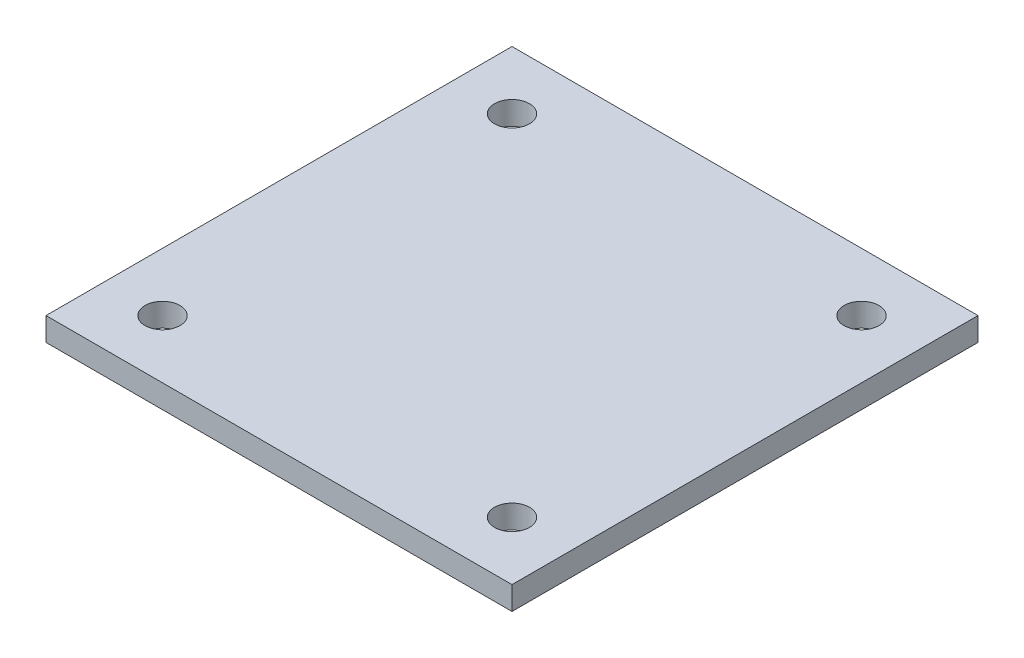
ISO-10303-21;
HEADER;
FILE_DESCRIPTION(('STEP AP214'),'2;1');
FILE_NAME('part.step','',(''),(''),'','','');
FILE_SCHEMA(('AUTOMOTIVE_DESIGN { 1 0 10303 214 1 1 1 1 }'));
ENDSEC;
DATA;
#1=APPLICATION_CONTEXT('core data for automotive mechanical design processes');
#2=APPLICATION_PROTOCOL_DEFINITION('international standard','automotive_design',2000,#1);
#3=PRODUCT_CONTEXT('',#1,'mechanical');
#4=PRODUCT('Part','Part','',(#3));
#5=PRODUCT_RELATED_PRODUCT_CATEGORY('part','',(#4));
#6=PRODUCT_DEFINITION_FORMATION('','',#4);
#7=PRODUCT_DEFINITION_CONTEXT('part definition',#1,'design');
#8=PRODUCT_DEFINITION('design','',#6,#7);
#9=PRODUCT_DEFINITION_SHAPE('','',#8);
#10=(LENGTH_UNIT() NAMED_UNIT(*) SI_UNIT(.MILLI.,.METRE.));
#11=(NAMED_UNIT(*) PLANE_ANGLE_UNIT() SI_UNIT($,.RADIAN.));
#12=(NAMED_UNIT(*) SI_UNIT($,.STERADIAN.) SOLID_ANGLE_UNIT());
#13=UNCERTAINTY_MEASURE_WITH_UNIT(LENGTH_MEASURE(1.E-05),#10,'distance_accuracy_value','');
#14=(GEOMETRIC_REPRESENTATION_CONTEXT(3) GLOBAL_UNCERTAINTY_ASSIGNED_CONTEXT((#13)) GLOBAL_UNIT_ASSIGNED_CONTEXT((#10,
#11,#12)) REPRESENTATION_CONTEXT('',''));
#15=CARTESIAN_POINT('',(0.,0.,0.));
#16=DIRECTION('',(0.,0.,1.));
#17=DIRECTION('',(1.,0.,0.));
#18=AXIS2_PLACEMENT_3D('',#15,#16,#17);
#19=CARTESIAN_POINT('',(0.,2.,0.));
#20=DIRECTION('',(1.,0.,0.));
#21=DIRECTION('',(0.,0.,-1.));
#22=AXIS2_PLACEMENT_3D('',#19,#20,#21);
#23=PLANE('',#22);
#24=DIRECTION('',(0.,0.,1.));
#25=VECTOR('',#24,1.);
#26=CARTESIAN_POINT('',(0.,0.,0.));
#27=LINE('',#26,#25);
#28=CARTESIAN_POINT('',(0.,0.,-40.));
#29=VERTEX_POINT('',#28);
#30=CARTESIAN_POINT('',(0.,0.,0.));
#31=VERTEX_POINT('',#30);
#32=EDGE_CURVE('E95',#29,#31,#27,.T.);
#33=ORIENTED_EDGE('',*,*,#32,.T.);
#34=DIRECTION('',(0.,-1.,0.));
#35=VECTOR('',#34,1.);
#36=CARTESIAN_POINT('',(0.,2.,0.));
#37=LINE('',#36,#35);
#38=CARTESIAN_POINT('',(0.,2.,0.));
#39=VERTEX_POINT('',#38);
#40=EDGE_CURVE('E11',#39,#31,#37,.T.);
#41=ORIENTED_EDGE('',*,*,#40,.F.);
#42=DIRECTION('',(0.,0.,1.));
#43=VECTOR('',#42,1.);
#44=CARTESIAN_POINT('',(0.,2.,0.));
#45=LINE('',#44,#43);
#46=CARTESIAN_POINT('',(0.,2.,-40.));
#47=VERTEX_POINT('',#46);
#48=EDGE_CURVE('E83',#47,#39,#45,.T.);
#49=ORIENTED_EDGE('',*,*,#48,.F.);
#50=DIRECTION('',(0.,-1.,0.));
#51=VECTOR('',#50,1.);
#52=CARTESIAN_POINT('',(0.,2.,-40.));
#53=LINE('',#52,#51);
#54=EDGE_CURVE('E91',#47,#29,#53,.T.);
#55=ORIENTED_EDGE('',*,*,#54,.T.);
#56=EDGE_LOOP('',(#33,#41,#49,#55));
#57=FACE_BOUND('',#56,.T.);
#58=ADVANCED_FACE('F32',(#57),#23,.F.);
#59=CARTESIAN_POINT('',(0.,2.,0.));
#60=DIRECTION('',(0.,0.,-1.));
#61=DIRECTION('',(-1.,0.,0.));
#62=AXIS2_PLACEMENT_3D('',#59,#60,#61);
#63=PLANE('',#62);
#64=DIRECTION('',(1.,0.,0.));
#65=VECTOR('',#64,1.);
#66=CARTESIAN_POINT('',(0.,0.,0.));
#67=LINE('',#66,#65);
#68=CARTESIAN_POINT('',(40.,0.,0.));
#69=VERTEX_POINT('',#68);
#70=EDGE_CURVE('E87',#31,#69,#67,.T.);
#71=ORIENTED_EDGE('',*,*,#70,.T.);
#72=DIRECTION('',(0.,-1.,0.));
#73=VECTOR('',#72,1.);
#74=CARTESIAN_POINT('',(40.,2.,0.));
#75=LINE('',#74,#73);
#76=CARTESIAN_POINT('',(40.,2.,0.));
#77=VERTEX_POINT('',#76);
#78=EDGE_CURVE('E40',#77,#69,#75,.T.);
#79=ORIENTED_EDGE('',*,*,#78,.F.);
#80=DIRECTION('',(1.,0.,0.));
#81=VECTOR('',#80,1.);
#82=CARTESIAN_POINT('',(0.,2.,0.));
#83=LINE('',#82,#81);
#84=EDGE_CURVE('E78',#39,#77,#83,.T.);
#85=ORIENTED_EDGE('',*,*,#84,.F.);
#86=ORIENTED_EDGE('',*,*,#40,.T.);
#87=EDGE_LOOP('',(#71,#79,#85,#86));
#88=FACE_BOUND('',#87,.T.);
#89=ADVANCED_FACE('F86',(#88),#63,.F.);
#90=CARTESIAN_POINT('',(40.,2.,0.));
#91=DIRECTION('',(-1.,0.,0.));
#92=DIRECTION('',(0.,0.,1.));
#93=AXIS2_PLACEMENT_3D('',#90,#91,#92);
#94=PLANE('',#93);
#95=DIRECTION('',(0.,0.,-1.));
#96=VECTOR('',#95,1.);
#97=CARTESIAN_POINT('',(40.,0.,0.));
#98=LINE('',#97,#96);
#99=CARTESIAN_POINT('',(40.,0.,-40.));
#100=VERTEX_POINT('',#99);
#101=EDGE_CURVE('E65',#69,#100,#98,.T.);
#102=ORIENTED_EDGE('',*,*,#101,.T.);
#103=DIRECTION('',(0.,-1.,0.));
#104=VECTOR('',#103,1.);
#105=CARTESIAN_POINT('',(40.,2.,-40.));
#106=LINE('',#105,#104);
#107=CARTESIAN_POINT('',(40.,2.,-40.));
#108=VERTEX_POINT('',#107);
#109=EDGE_CURVE('E88',#108,#100,#106,.T.);
#110=ORIENTED_EDGE('',*,*,#109,.F.);
#111=DIRECTION('',(0.,0.,-1.));
#112=VECTOR('',#111,1.);
#113=CARTESIAN_POINT('',(40.,2.,0.));
#114=LINE('',#113,#112);
#115=EDGE_CURVE('E81',#77,#108,#114,.T.);
#116=ORIENTED_EDGE('',*,*,#115,.F.);
#117=ORIENTED_EDGE('',*,*,#78,.T.);
#118=EDGE_LOOP('',(#102,#110,#116,#117));
#119=FACE_BOUND('',#118,.T.);
#120=ADVANCED_FACE('F89',(#119),#94,.F.);
#121=CARTESIAN_POINT('',(0.,2.,-40.));
#122=DIRECTION('',(0.,0.,1.));
#123=DIRECTION('',(1.,0.,0.));
#124=AXIS2_PLACEMENT_3D('',#121,#122,#123);
#125=PLANE('',#124);
#126=DIRECTION('',(-1.,0.,0.));
#127=VECTOR('',#126,1.);
#128=CARTESIAN_POINT('',(0.,0.,-40.));
#129=LINE('',#128,#127);
#130=EDGE_CURVE('E71',#100,#29,#129,.T.);
#131=ORIENTED_EDGE('',*,*,#130,.T.);
#132=ORIENTED_EDGE('',*,*,#54,.F.);
#133=DIRECTION('',(-1.,0.,0.));
#134=VECTOR('',#133,1.);
#135=CARTESIAN_POINT('',(0.,2.,-40.));
#136=LINE('',#135,#134);
#137=EDGE_CURVE('E48',#108,#47,#136,.T.);
#138=ORIENTED_EDGE('',*,*,#137,.F.);
#139=ORIENTED_EDGE('',*,*,#109,.T.);
#140=EDGE_LOOP('',(#131,#132,#138,#139));
#141=FACE_BOUND('',#140,.T.);
#142=ADVANCED_FACE('F103',(#141),#125,.F.);
#143=CARTESIAN_POINT('',(0.,2.,0.));
#144=DIRECTION('',(0.,-1.,0.));
#145=DIRECTION('',(0.,0.,-1.));
#146=AXIS2_PLACEMENT_3D('',#143,#144,#145);
#147=PLANE('',#146);
#148=CARTESIAN_POINT('',(35.,2.,-35.));
#149=DIRECTION('',(0.,-1.,0.));
#150=DIRECTION('',(0.,0.,-1.));
#151=AXIS2_PLACEMENT_3D('',#148,#149,#150);
#152=CIRCLE('',#151,1.5);
#153=CARTESIAN_POINT('',(35.,2.,-36.5));
#154=VERTEX_POINT('',#153);
#155=EDGE_CURVE('E114',#154,#154,#152,.F.);
#156=ORIENTED_EDGE('',*,*,#155,.F.);
#157=EDGE_LOOP('',(#156));
#158=FACE_BOUND('',#157,.T.);
#159=CARTESIAN_POINT('',(5.,2.,-5.));
#160=DIRECTION('',(0.,-1.,0.));
#161=DIRECTION('',(0.,0.,-1.));
#162=AXIS2_PLACEMENT_3D('',#159,#160,#161);
#163=CIRCLE('',#162,1.5);
#164=CARTESIAN_POINT('',(5.,2.,-6.5));
#165=VERTEX_POINT('',#164);
#166=EDGE_CURVE('E122',#165,#165,#163,.F.);
#167=ORIENTED_EDGE('',*,*,#166,.F.);
#168=EDGE_LOOP('',(#167));
#169=FACE_BOUND('',#168,.T.);
#170=CARTESIAN_POINT('',(5.,2.,-35.));
#171=DIRECTION('',(0.,-1.,0.));
#172=DIRECTION('',(0.,0.,-1.));
#173=AXIS2_PLACEMENT_3D('',#170,#171,#172);
#174=CIRCLE('',#173,1.5);
#175=CARTESIAN_POINT('',(5.,2.,-36.5));
#176=VERTEX_POINT('',#175);
#177=EDGE_CURVE('E115',#176,#176,#174,.F.);
#178=ORIENTED_EDGE('',*,*,#177,.F.);
#179=EDGE_LOOP('',(#178));
#180=FACE_BOUND('',#179,.T.);
#181=CARTESIAN_POINT('',(35.,2.,-5.));
#182=DIRECTION('',(0.,-1.,0.));
#183=DIRECTION('',(0.,0.,-1.));
#184=AXIS2_PLACEMENT_3D('',#181,#182,#183);
#185=CIRCLE('',#184,1.5);
#186=CARTESIAN_POINT('',(35.,2.,-6.50000000000001));
#187=VERTEX_POINT('',#186);
#188=EDGE_CURVE('E98',#187,#187,#185,.F.);
#189=ORIENTED_EDGE('',*,*,#188,.F.);
#190=EDGE_LOOP('',(#189));
#191=FACE_BOUND('',#190,.T.);
#192=ORIENTED_EDGE('',*,*,#48,.T.);
#193=ORIENTED_EDGE('',*,*,#84,.T.);
#194=ORIENTED_EDGE('',*,*,#115,.T.);
#195=ORIENTED_EDGE('',*,*,#137,.T.);
#196=EDGE_LOOP('',(#192,#193,#194,#195));
#197=FACE_BOUND('',#196,.T.);
#198=ADVANCED_FACE('F79',(#158,#169,#180,#191,#197),#147,.F.);
#199=CARTESIAN_POINT('',(0.,0.,0.));
#200=DIRECTION('',(0.,-1.,0.));
#201=DIRECTION('',(0.,0.,-1.));
#202=AXIS2_PLACEMENT_3D('',#199,#200,#201);
#203=PLANE('',#202);
#204=CARTESIAN_POINT('',(35.,0.,-35.));
#205=DIRECTION('',(0.,-1.,0.));
#206=DIRECTION('',(0.,0.,-1.));
#207=AXIS2_PLACEMENT_3D('',#204,#205,#206);
#208=CIRCLE('',#207,1.5);
#209=CARTESIAN_POINT('',(35.,0.,-36.5));
#210=VERTEX_POINT('',#209);
#211=EDGE_CURVE('E125',#210,#210,#208,.T.);
#212=ORIENTED_EDGE('',*,*,#211,.F.);
#213=EDGE_LOOP('',(#212));
#214=FACE_BOUND('',#213,.T.);
#215=CARTESIAN_POINT('',(5.,0.,-5.));
#216=DIRECTION('',(0.,-1.,0.));
#217=DIRECTION('',(0.,0.,-1.));
#218=AXIS2_PLACEMENT_3D('',#215,#216,#217);
#219=CIRCLE('',#218,1.5);
#220=CARTESIAN_POINT('',(5.,0.,-6.5));
#221=VERTEX_POINT('',#220);
#222=EDGE_CURVE('E118',#221,#221,#219,.T.);
#223=ORIENTED_EDGE('',*,*,#222,.F.);
#224=EDGE_LOOP('',(#223));
#225=FACE_BOUND('',#224,.T.);
#226=CARTESIAN_POINT('',(5.,0.,-35.));
#227=DIRECTION('',(0.,-1.,0.));
#228=DIRECTION('',(0.,0.,-1.));
#229=AXIS2_PLACEMENT_3D('',#226,#227,#228);
#230=CIRCLE('',#229,1.5);
#231=CARTESIAN_POINT('',(5.,0.,-36.5));
#232=VERTEX_POINT('',#231);
#233=EDGE_CURVE('E119',#232,#232,#230,.T.);
#234=ORIENTED_EDGE('',*,*,#233,.F.);
#235=EDGE_LOOP('',(#234));
#236=FACE_BOUND('',#235,.T.);
#237=CARTESIAN_POINT('',(35.,0.,-5.));
#238=DIRECTION('',(0.,-1.,0.));
#239=DIRECTION('',(0.,0.,-1.));
#240=AXIS2_PLACEMENT_3D('',#237,#238,#239);
#241=CIRCLE('',#240,1.5);
#242=CARTESIAN_POINT('',(35.,0.,-6.50000000000001));
#243=VERTEX_POINT('',#242);
#244=EDGE_CURVE('E111',#243,#243,#241,.T.);
#245=ORIENTED_EDGE('',*,*,#244,.F.);
#246=EDGE_LOOP('',(#245));
#247=FACE_BOUND('',#246,.T.);
#248=ORIENTED_EDGE('',*,*,#32,.F.);
#249=ORIENTED_EDGE('',*,*,#130,.F.);
#250=ORIENTED_EDGE('',*,*,#101,.F.);
#251=ORIENTED_EDGE('',*,*,#70,.F.);
#252=EDGE_LOOP('',(#248,#249,#250,#251));
#253=FACE_BOUND('',#252,.T.);
#254=ADVANCED_FACE('F106',(#214,#225,#236,#247,#253),#203,.T.);
#255=CARTESIAN_POINT('',(35.,6.24264068711929,-5.));
#256=DIRECTION('',(0.,-1.,0.));
#257=DIRECTION('',(0.,0.,-1.));
#258=AXIS2_PLACEMENT_3D('',#255,#256,#257);
#259=CYLINDRICAL_SURFACE('',#258,1.5);
#260=ORIENTED_EDGE('',*,*,#188,.T.);
#261=EDGE_LOOP('',(#260));
#262=FACE_BOUND('',#261,.T.);
#263=ORIENTED_EDGE('',*,*,#244,.T.);
#264=EDGE_LOOP('',(#263));
#265=FACE_BOUND('',#264,.T.);
#266=ADVANCED_FACE('F137',(#262,#265),#259,.F.);
#267=CARTESIAN_POINT('',(5.,6.24264068711929,-35.));
#268=DIRECTION('',(0.,-1.,0.));
#269=DIRECTION('',(0.,0.,-1.));
#270=AXIS2_PLACEMENT_3D('',#267,#268,#269);
#271=CYLINDRICAL_SURFACE('',#270,1.5);
#272=ORIENTED_EDGE('',*,*,#177,.T.);
#273=EDGE_LOOP('',(#272));
#274=FACE_BOUND('',#273,.T.);
#275=ORIENTED_EDGE('',*,*,#233,.T.);
#276=EDGE_LOOP('',(#275));
#277=FACE_BOUND('',#276,.T.);
#278=ADVANCED_FACE('F146',(#274,#277),#271,.F.);
#279=CARTESIAN_POINT('',(5.,6.24264068711929,-5.));
#280=DIRECTION('',(0.,-1.,0.));
#281=DIRECTION('',(0.,0.,-1.));
#282=AXIS2_PLACEMENT_3D('',#279,#280,#281);
#283=CYLINDRICAL_SURFACE('',#282,1.5);
#284=ORIENTED_EDGE('',*,*,#166,.T.);
#285=EDGE_LOOP('',(#284));
#286=FACE_BOUND('',#285,.T.);
#287=ORIENTED_EDGE('',*,*,#222,.T.);
#288=EDGE_LOOP('',(#287));
#289=FACE_BOUND('',#288,.T.);
#290=ADVANCED_FACE('F152',(#286,#289),#283,.F.);
#291=CARTESIAN_POINT('',(35.,6.24264068711929,-35.));
#292=DIRECTION('',(0.,-1.,0.));
#293=DIRECTION('',(0.,0.,-1.));
#294=AXIS2_PLACEMENT_3D('',#291,#292,#293);
#295=CYLINDRICAL_SURFACE('',#294,1.5);
#296=ORIENTED_EDGE('',*,*,#155,.T.);
#297=EDGE_LOOP('',(#296));
#298=FACE_BOUND('',#297,.T.);
#299=ORIENTED_EDGE('',*,*,#211,.T.);
#300=EDGE_LOOP('',(#299));
#301=FACE_BOUND('',#300,.T.);
#302=ADVANCED_FACE('F133',(#298,#301),#295,.F.);
#303=CLOSED_SHELL('',(#58,#89,#120,#142,#198,#254,#266,#278,#290,#302));
#304=MANIFOLD_SOLID_BREP('B2',#303);
#305=ADVANCED_BREP_SHAPE_REPRESENTATION('',(#18,#304),#14);
#306=SHAPE_DEFINITION_REPRESENTATION(#9,#305);
ENDSEC;
END-ISO-10303-21;
